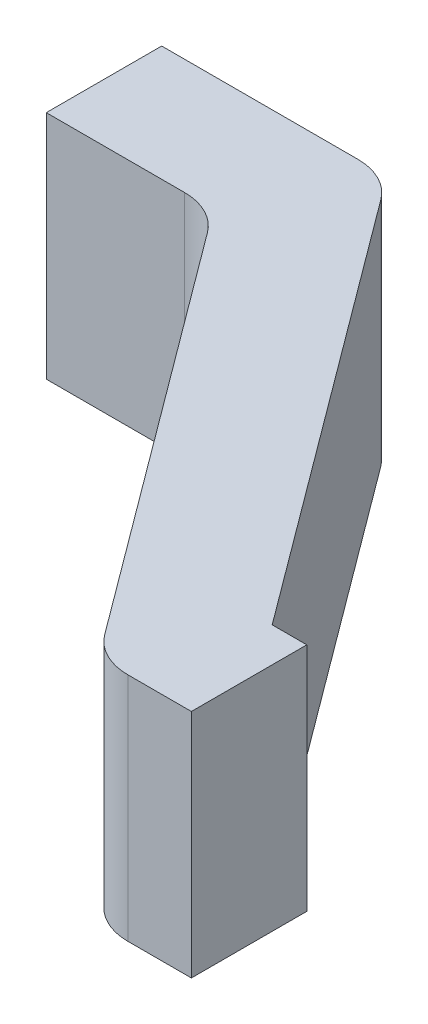
ISO-10303-21;
HEADER;
FILE_DESCRIPTION(('STEP AP214'),'2;1');
FILE_NAME('part.step','',(''),(''),'','','');
FILE_SCHEMA(('AUTOMOTIVE_DESIGN { 1 0 10303 214 1 1 1 1 }'));
ENDSEC;
DATA;
#1=APPLICATION_CONTEXT('core data for automotive mechanical design processes');
#2=APPLICATION_PROTOCOL_DEFINITION('international standard','automotive_design',2000,#1);
#3=PRODUCT_CONTEXT('',#1,'mechanical');
#4=PRODUCT('Part','Part','',(#3));
#5=PRODUCT_RELATED_PRODUCT_CATEGORY('part','',(#4));
#6=PRODUCT_DEFINITION_FORMATION('','',#4);
#7=PRODUCT_DEFINITION_CONTEXT('part definition',#1,'design');
#8=PRODUCT_DEFINITION('design','',#6,#7);
#9=PRODUCT_DEFINITION_SHAPE('','',#8);
#10=(LENGTH_UNIT() NAMED_UNIT(*) SI_UNIT(.MILLI.,.METRE.));
#11=(NAMED_UNIT(*) PLANE_ANGLE_UNIT() SI_UNIT($,.RADIAN.));
#12=(NAMED_UNIT(*) SI_UNIT($,.STERADIAN.) SOLID_ANGLE_UNIT());
#13=UNCERTAINTY_MEASURE_WITH_UNIT(LENGTH_MEASURE(1.E-05),#10,'distance_accuracy_value','');
#14=(GEOMETRIC_REPRESENTATION_CONTEXT(3) GLOBAL_UNCERTAINTY_ASSIGNED_CONTEXT((#13)) GLOBAL_UNIT_ASSIGNED_CONTEXT((#10,
#11,#12)) REPRESENTATION_CONTEXT('',''));
#15=CARTESIAN_POINT('',(0.,0.,0.));
#16=DIRECTION('',(0.,0.,1.));
#17=DIRECTION('',(1.,0.,0.));
#18=AXIS2_PLACEMENT_3D('',#15,#16,#17);
#19=CARTESIAN_POINT('',(-3.,-2.11,0.205));
#20=DIRECTION('',(0.,0.,1.));
#21=DIRECTION('',(1.,0.,0.));
#22=AXIS2_PLACEMENT_3D('',#19,#20,#21);
#23=PLANE('',#22);
#24=DIRECTION('',(1.,0.,0.));
#25=VECTOR('',#24,1.);
#26=CARTESIAN_POINT('',(-3.,-1.7,0.205));
#27=LINE('',#26,#25);
#28=CARTESIAN_POINT('',(-3.,-1.7,0.205));
#29=VERTEX_POINT('',#28);
#30=CARTESIAN_POINT('',(-2.754632601552,-1.7,0.205));
#31=VERTEX_POINT('',#30);
#32=EDGE_CURVE('E11',#29,#31,#27,.T.);
#33=ORIENTED_EDGE('',*,*,#32,.F.);
#34=DIRECTION('',(0.,1.,0.));
#35=VECTOR('',#34,1.);
#36=CARTESIAN_POINT('',(-3.,-2.11,0.205));
#37=LINE('',#36,#35);
#38=CARTESIAN_POINT('',(-3.,-2.11,0.205));
#39=VERTEX_POINT('',#38);
#40=EDGE_CURVE('E24',#39,#29,#37,.T.);
#41=ORIENTED_EDGE('',*,*,#40,.F.);
#42=DIRECTION('',(1.,0.,0.));
#43=VECTOR('',#42,1.);
#44=CARTESIAN_POINT('',(-3.,-2.11,0.205));
#45=LINE('',#44,#43);
#46=CARTESIAN_POINT('',(-2.754632601552,-2.11,0.205));
#47=VERTEX_POINT('',#46);
#48=EDGE_CURVE('E186',#39,#47,#45,.T.);
#49=ORIENTED_EDGE('',*,*,#48,.T.);
#50=DIRECTION('',(0.,1.,0.));
#51=VECTOR('',#50,1.);
#52=CARTESIAN_POINT('',(-2.754632601552,-2.11,0.205));
#53=LINE('',#52,#51);
#54=EDGE_CURVE('E184',#47,#31,#53,.T.);
#55=ORIENTED_EDGE('',*,*,#54,.T.);
#56=EDGE_LOOP('',(#33,#41,#49,#55));
#57=FACE_BOUND('',#56,.T.);
#58=ADVANCED_FACE('F17',(#57),#23,.T.);
#59=CARTESIAN_POINT('',(-3.,-1.7,0.));
#60=DIRECTION('',(0.,1.,0.));
#61=DIRECTION('',(0.,0.,1.));
#62=AXIS2_PLACEMENT_3D('',#59,#60,#61);
#63=PLANE('',#62);
#64=DIRECTION('',(1.,0.,0.));
#65=VECTOR('',#64,1.);
#66=CARTESIAN_POINT('',(-3.,-1.7,0.));
#67=LINE('',#66,#65);
#68=CARTESIAN_POINT('',(-3.,-1.7,0.));
#69=VERTEX_POINT('',#68);
#70=CARTESIAN_POINT('',(-2.651544200517,-1.7,0.));
#71=VERTEX_POINT('',#70);
#72=EDGE_CURVE('E182',#69,#71,#67,.T.);
#73=ORIENTED_EDGE('',*,*,#72,.F.);
#74=DIRECTION('',(0.,0.,1.));
#75=VECTOR('',#74,1.);
#76=CARTESIAN_POINT('',(-3.,-1.7,0.));
#77=LINE('',#76,#75);
#78=EDGE_CURVE('E180',#69,#29,#77,.T.);
#79=ORIENTED_EDGE('',*,*,#78,.T.);
#80=ORIENTED_EDGE('',*,*,#32,.T.);
#81=CARTESIAN_POINT('',(-2.754632601552,-1.7,0.3075));
#82=DIRECTION('',(0.,-1.,0.));
#83=DIRECTION('',(0.,0.,1.));
#84=AXIS2_PLACEMENT_3D('',#81,#82,#83);
#85=CIRCLE('',#84,0.1025);
#86=CARTESIAN_POINT('',(-2.672351357136,-1.7,0.246376789863));
#87=VERTEX_POINT('',#86);
#88=EDGE_CURVE('E178',#31,#87,#85,.T.);
#89=ORIENTED_EDGE('',*,*,#88,.T.);
#90=DIRECTION('',(0.596324001338072,0.,0.802743847954097));
#91=VECTOR('',#90,1.);
#92=CARTESIAN_POINT('',(-2.764562488831,-1.7,0.122246420274));
#93=LINE('',#92,#91);
#94=CARTESIAN_POINT('',(-2.145299532729,-1.7,0.955869630411));
#95=VERTEX_POINT('',#94);
#96=EDGE_CURVE('E176',#87,#95,#93,.T.);
#97=ORIENTED_EDGE('',*,*,#96,.T.);
#98=CARTESIAN_POINT('',(-2.063018288313,-1.7,0.894746420274));
#99=DIRECTION('',(0.,1.,0.));
#100=DIRECTION('',(0.,0.,1.));
#101=AXIS2_PLACEMENT_3D('',#98,#99,#100);
#102=CIRCLE('',#101,0.1025);
#103=CARTESIAN_POINT('',(-2.063018288313,-1.7,0.997246420274));
#104=VERTEX_POINT('',#103);
#105=EDGE_CURVE('E120',#95,#104,#102,.T.);
#106=ORIENTED_EDGE('',*,*,#105,.T.);
#107=DIRECTION('',(1.,0.,0.));
#108=VECTOR('',#107,1.);
#109=CARTESIAN_POINT('',(-2.114562488831,-1.7,0.997246420274));
#110=LINE('',#109,#108);
#111=CARTESIAN_POINT('',(-1.95,-1.7,0.997246420274));
#112=VERTEX_POINT('',#111);
#113=EDGE_CURVE('E173',#104,#112,#110,.T.);
#114=ORIENTED_EDGE('',*,*,#113,.T.);
#115=DIRECTION('',(0.,0.,1.));
#116=VECTOR('',#115,1.);
#117=CARTESIAN_POINT('',(-1.95,-1.7,0.792246420274));
#118=LINE('',#117,#116);
#119=CARTESIAN_POINT('',(-1.95,-1.7,0.792246420274));
#120=VERTEX_POINT('',#119);
#121=EDGE_CURVE('E170',#120,#112,#118,.T.);
#122=ORIENTED_EDGE('',*,*,#121,.F.);
#123=DIRECTION('',(1.,0.,0.));
#124=VECTOR('',#123,1.);
#125=CARTESIAN_POINT('',(-2.114562488831,-1.7,0.792246420274));
#126=LINE('',#125,#124);
#127=CARTESIAN_POINT('',(-2.011474087796,-1.7,0.792246420274));
#128=VERTEX_POINT('',#127);
#129=EDGE_CURVE('E167',#128,#120,#126,.T.);
#130=ORIENTED_EDGE('',*,*,#129,.F.);
#131=DIRECTION('',(0.596324001338072,0.,0.802743847954097));
#132=VECTOR('',#131,1.);
#133=CARTESIAN_POINT('',(-2.6,-1.7,0.));
#134=LINE('',#133,#132);
#135=CARTESIAN_POINT('',(-2.569262956102,-1.7,0.0413767898629));
#136=VERTEX_POINT('',#135);
#137=EDGE_CURVE('E164',#136,#128,#134,.T.);
#138=ORIENTED_EDGE('',*,*,#137,.F.);
#139=CARTESIAN_POINT('',(-2.651544200517,-1.7,0.1025));
#140=DIRECTION('',(0.,-1.,0.));
#141=DIRECTION('',(0.,0.,1.));
#142=AXIS2_PLACEMENT_3D('',#139,#140,#141);
#143=CIRCLE('',#142,0.1025);
#144=EDGE_CURVE('E161',#71,#136,#143,.T.);
#145=ORIENTED_EDGE('',*,*,#144,.F.);
#146=EDGE_LOOP('',(#73,#79,#80,#89,#97,#106,#114,#122,#130,#138,#145));
#147=FACE_BOUND('',#146,.T.);
#148=ADVANCED_FACE('F192',(#147),#63,.T.);
#149=CARTESIAN_POINT('',(-2.754632601552,-2.11,0.3075));
#150=DIRECTION('',(0.,1.,0.));
#151=DIRECTION('',(0.,0.,-1.));
#152=AXIS2_PLACEMENT_3D('',#149,#150,#151);
#153=CYLINDRICAL_SURFACE('',#152,0.1025);
#154=CARTESIAN_POINT('',(-2.754632601552,-2.11,0.3075));
#155=DIRECTION('',(0.,-1.,0.));
#156=DIRECTION('',(0.,0.,1.));
#157=AXIS2_PLACEMENT_3D('',#154,#155,#156);
#158=CIRCLE('',#157,0.1025);
#159=CARTESIAN_POINT('',(-2.672351357136,-2.11,0.246376789863));
#160=VERTEX_POINT('',#159);
#161=EDGE_CURVE('E159',#47,#160,#158,.T.);
#162=ORIENTED_EDGE('',*,*,#161,.T.);
#163=DIRECTION('',(0.,1.,0.));
#164=VECTOR('',#163,1.);
#165=CARTESIAN_POINT('',(-2.672351357136,-2.11,0.246376789863));
#166=LINE('',#165,#164);
#167=EDGE_CURVE('E102',#160,#87,#166,.T.);
#168=ORIENTED_EDGE('',*,*,#167,.T.);
#169=ORIENTED_EDGE('',*,*,#88,.F.);
#170=ORIENTED_EDGE('',*,*,#54,.F.);
#171=EDGE_LOOP('',(#162,#168,#169,#170));
#172=FACE_BOUND('',#171,.T.);
#173=ADVANCED_FACE('F216',(#172),#153,.F.);
#174=CARTESIAN_POINT('',(-3.,-2.11,0.));
#175=DIRECTION('',(1.,0.,0.));
#176=DIRECTION('',(0.,0.,1.));
#177=AXIS2_PLACEMENT_3D('',#174,#175,#176);
#178=PLANE('',#177);
#179=ORIENTED_EDGE('',*,*,#40,.T.);
#180=ORIENTED_EDGE('',*,*,#78,.F.);
#181=DIRECTION('',(0.,1.,0.));
#182=VECTOR('',#181,1.);
#183=CARTESIAN_POINT('',(-3.,-2.11,0.));
#184=LINE('',#183,#182);
#185=CARTESIAN_POINT('',(-3.,-2.11,0.));
#186=VERTEX_POINT('',#185);
#187=EDGE_CURVE('E155',#186,#69,#184,.T.);
#188=ORIENTED_EDGE('',*,*,#187,.F.);
#189=DIRECTION('',(0.,0.,1.));
#190=VECTOR('',#189,1.);
#191=CARTESIAN_POINT('',(-3.,-2.11,0.));
#192=LINE('',#191,#190);
#193=EDGE_CURVE('E152',#186,#39,#192,.T.);
#194=ORIENTED_EDGE('',*,*,#193,.T.);
#195=EDGE_LOOP('',(#179,#180,#188,#194));
#196=FACE_BOUND('',#195,.T.);
#197=ADVANCED_FACE('F189',(#196),#178,.F.);
#198=CARTESIAN_POINT('',(-3.,-2.11,0.));
#199=DIRECTION('',(0.,1.,0.));
#200=DIRECTION('',(0.,0.,1.));
#201=AXIS2_PLACEMENT_3D('',#198,#199,#200);
#202=PLANE('',#201);
#203=CARTESIAN_POINT('',(-2.651544200517,-2.11,0.1025));
#204=DIRECTION('',(0.,-1.,0.));
#205=DIRECTION('',(0.,0.,1.));
#206=AXIS2_PLACEMENT_3D('',#203,#204,#205);
#207=CIRCLE('',#206,0.1025);
#208=CARTESIAN_POINT('',(-2.651544200517,-2.11,0.));
#209=VERTEX_POINT('',#208);
#210=CARTESIAN_POINT('',(-2.569262956102,-2.11,0.0413767898629));
#211=VERTEX_POINT('',#210);
#212=EDGE_CURVE('E150',#209,#211,#207,.T.);
#213=ORIENTED_EDGE('',*,*,#212,.T.);
#214=DIRECTION('',(0.596324001338072,0.,0.802743847954097));
#215=VECTOR('',#214,1.);
#216=CARTESIAN_POINT('',(-2.6,-2.11,0.));
#217=LINE('',#216,#215);
#218=CARTESIAN_POINT('',(-2.011474087796,-2.11,0.792246420274));
#219=VERTEX_POINT('',#218);
#220=EDGE_CURVE('E147',#211,#219,#217,.T.);
#221=ORIENTED_EDGE('',*,*,#220,.T.);
#222=DIRECTION('',(1.,0.,0.));
#223=VECTOR('',#222,1.);
#224=CARTESIAN_POINT('',(-2.114562488831,-2.11,0.792246420274));
#225=LINE('',#224,#223);
#226=CARTESIAN_POINT('',(-1.95,-2.11,0.792246420274));
#227=VERTEX_POINT('',#226);
#228=EDGE_CURVE('E144',#219,#227,#225,.T.);
#229=ORIENTED_EDGE('',*,*,#228,.T.);
#230=DIRECTION('',(0.,0.,1.));
#231=VECTOR('',#230,1.);
#232=CARTESIAN_POINT('',(-1.95,-2.11,0.792246420274));
#233=LINE('',#232,#231);
#234=CARTESIAN_POINT('',(-1.95,-2.11,0.997246420274));
#235=VERTEX_POINT('',#234);
#236=EDGE_CURVE('E142',#227,#235,#233,.T.);
#237=ORIENTED_EDGE('',*,*,#236,.T.);
#238=DIRECTION('',(1.,0.,0.));
#239=VECTOR('',#238,1.);
#240=CARTESIAN_POINT('',(-2.114562488831,-2.11,0.997246420274));
#241=LINE('',#240,#239);
#242=CARTESIAN_POINT('',(-2.063018288313,-2.11,0.997246420274));
#243=VERTEX_POINT('',#242);
#244=EDGE_CURVE('E113',#243,#235,#241,.T.);
#245=ORIENTED_EDGE('',*,*,#244,.F.);
#246=CARTESIAN_POINT('',(-2.063018288313,-2.11,0.894746420274));
#247=DIRECTION('',(0.,1.,0.));
#248=DIRECTION('',(0.,0.,1.));
#249=AXIS2_PLACEMENT_3D('',#246,#247,#248);
#250=CIRCLE('',#249,0.1025);
#251=CARTESIAN_POINT('',(-2.145299532729,-2.11,0.955869630411));
#252=VERTEX_POINT('',#251);
#253=EDGE_CURVE('E106',#252,#243,#250,.T.);
#254=ORIENTED_EDGE('',*,*,#253,.F.);
#255=DIRECTION('',(0.596324001338072,0.,0.802743847954097));
#256=VECTOR('',#255,1.);
#257=CARTESIAN_POINT('',(-2.764562488831,-2.11,0.122246420274));
#258=LINE('',#257,#256);
#259=EDGE_CURVE('E95',#160,#252,#258,.T.);
#260=ORIENTED_EDGE('',*,*,#259,.F.);
#261=ORIENTED_EDGE('',*,*,#161,.F.);
#262=ORIENTED_EDGE('',*,*,#48,.F.);
#263=ORIENTED_EDGE('',*,*,#193,.F.);
#264=DIRECTION('',(1.,0.,0.));
#265=VECTOR('',#264,1.);
#266=CARTESIAN_POINT('',(-3.,-2.11,0.));
#267=LINE('',#266,#265);
#268=EDGE_CURVE('E107',#186,#209,#267,.T.);
#269=ORIENTED_EDGE('',*,*,#268,.T.);
#270=EDGE_LOOP('',(#213,#221,#229,#237,#245,#254,#260,#261,#262,#263,#269));
#271=FACE_BOUND('',#270,.T.);
#272=ADVANCED_FACE('F111',(#271),#202,.F.);
#273=CARTESIAN_POINT('',(-3.,-2.11,0.));
#274=DIRECTION('',(0.,0.,1.));
#275=DIRECTION('',(1.,0.,0.));
#276=AXIS2_PLACEMENT_3D('',#273,#274,#275);
#277=PLANE('',#276);
#278=DIRECTION('',(0.,1.,0.));
#279=VECTOR('',#278,1.);
#280=CARTESIAN_POINT('',(-2.651544200517,-2.11,0.));
#281=LINE('',#280,#279);
#282=EDGE_CURVE('E137',#209,#71,#281,.T.);
#283=ORIENTED_EDGE('',*,*,#282,.F.);
#284=ORIENTED_EDGE('',*,*,#268,.F.);
#285=ORIENTED_EDGE('',*,*,#187,.T.);
#286=ORIENTED_EDGE('',*,*,#72,.T.);
#287=EDGE_LOOP('',(#283,#284,#285,#286));
#288=FACE_BOUND('',#287,.T.);
#289=ADVANCED_FACE('F196',(#288),#277,.F.);
#290=CARTESIAN_POINT('',(-2.651544200517,-2.11,0.1025));
#291=DIRECTION('',(0.,1.,0.));
#292=DIRECTION('',(0.,0.,-1.));
#293=AXIS2_PLACEMENT_3D('',#290,#291,#292);
#294=CYLINDRICAL_SURFACE('',#293,0.1025);
#295=ORIENTED_EDGE('',*,*,#282,.T.);
#296=ORIENTED_EDGE('',*,*,#144,.T.);
#297=DIRECTION('',(0.,1.,0.));
#298=VECTOR('',#297,1.);
#299=CARTESIAN_POINT('',(-2.569262956102,-2.11,0.0413767898629));
#300=LINE('',#299,#298);
#301=EDGE_CURVE('E134',#211,#136,#300,.T.);
#302=ORIENTED_EDGE('',*,*,#301,.F.);
#303=ORIENTED_EDGE('',*,*,#212,.F.);
#304=EDGE_LOOP('',(#295,#296,#302,#303));
#305=FACE_BOUND('',#304,.T.);
#306=ADVANCED_FACE('F201',(#305),#294,.T.);
#307=CARTESIAN_POINT('',(-2.6,-2.11,0.));
#308=DIRECTION('',(0.802743847954097,0.,-0.596324001338072));
#309=DIRECTION('',(0.596324001338072,0.,0.802743847954097));
#310=AXIS2_PLACEMENT_3D('',#307,#308,#309);
#311=PLANE('',#310);
#312=ORIENTED_EDGE('',*,*,#220,.F.);
#313=ORIENTED_EDGE('',*,*,#301,.T.);
#314=ORIENTED_EDGE('',*,*,#137,.T.);
#315=DIRECTION('',(0.,1.,0.));
#316=VECTOR('',#315,1.);
#317=CARTESIAN_POINT('',(-2.011474087796,-2.11,0.792246420274));
#318=LINE('',#317,#316);
#319=EDGE_CURVE('E131',#219,#128,#318,.T.);
#320=ORIENTED_EDGE('',*,*,#319,.F.);
#321=EDGE_LOOP('',(#312,#313,#314,#320));
#322=FACE_BOUND('',#321,.T.);
#323=ADVANCED_FACE('F203',(#322),#311,.T.);
#324=CARTESIAN_POINT('',(-2.114562488831,-2.11,0.792246420274));
#325=DIRECTION('',(0.,0.,1.));
#326=DIRECTION('',(1.,0.,0.));
#327=AXIS2_PLACEMENT_3D('',#324,#325,#326);
#328=PLANE('',#327);
#329=DIRECTION('',(0.,1.,0.));
#330=VECTOR('',#329,1.);
#331=CARTESIAN_POINT('',(-1.95,-2.11,0.792246420274));
#332=LINE('',#331,#330);
#333=EDGE_CURVE('E125',#227,#120,#332,.T.);
#334=ORIENTED_EDGE('',*,*,#333,.F.);
#335=ORIENTED_EDGE('',*,*,#228,.F.);
#336=ORIENTED_EDGE('',*,*,#319,.T.);
#337=ORIENTED_EDGE('',*,*,#129,.T.);
#338=EDGE_LOOP('',(#334,#335,#336,#337));
#339=FACE_BOUND('',#338,.T.);
#340=ADVANCED_FACE('F208',(#339),#328,.F.);
#341=CARTESIAN_POINT('',(-1.95,-2.11,0.792246420274));
#342=DIRECTION('',(1.,0.,0.));
#343=DIRECTION('',(0.,0.,1.));
#344=AXIS2_PLACEMENT_3D('',#341,#342,#343);
#345=PLANE('',#344);
#346=ORIENTED_EDGE('',*,*,#236,.F.);
#347=ORIENTED_EDGE('',*,*,#333,.T.);
#348=ORIENTED_EDGE('',*,*,#121,.T.);
#349=DIRECTION('',(0.,1.,0.));
#350=VECTOR('',#349,1.);
#351=CARTESIAN_POINT('',(-1.95,-2.11,0.997246420274));
#352=LINE('',#351,#350);
#353=EDGE_CURVE('E121',#235,#112,#352,.T.);
#354=ORIENTED_EDGE('',*,*,#353,.F.);
#355=EDGE_LOOP('',(#346,#347,#348,#354));
#356=FACE_BOUND('',#355,.T.);
#357=ADVANCED_FACE('F210',(#356),#345,.T.);
#358=CARTESIAN_POINT('',(-2.764562488831,-2.11,0.122246420274));
#359=DIRECTION('',(0.802743847954097,0.,-0.596324001338072));
#360=DIRECTION('',(0.596324001338072,0.,0.802743847954097));
#361=AXIS2_PLACEMENT_3D('',#358,#359,#360);
#362=PLANE('',#361);
#363=DIRECTION('',(0.,1.,0.));
#364=VECTOR('',#363,1.);
#365=CARTESIAN_POINT('',(-2.145299532729,-2.11,0.955869630411));
#366=LINE('',#365,#364);
#367=EDGE_CURVE('E100',#252,#95,#366,.T.);
#368=ORIENTED_EDGE('',*,*,#367,.T.);
#369=ORIENTED_EDGE('',*,*,#96,.F.);
#370=ORIENTED_EDGE('',*,*,#167,.F.);
#371=ORIENTED_EDGE('',*,*,#259,.T.);
#372=EDGE_LOOP('',(#368,#369,#370,#371));
#373=FACE_BOUND('',#372,.T.);
#374=ADVANCED_FACE('F97',(#373),#362,.F.);
#375=CARTESIAN_POINT('',(-2.114562488831,-2.11,0.997246420274));
#376=DIRECTION('',(0.,0.,1.));
#377=DIRECTION('',(1.,0.,0.));
#378=AXIS2_PLACEMENT_3D('',#375,#376,#377);
#379=PLANE('',#378);
#380=ORIENTED_EDGE('',*,*,#244,.T.);
#381=ORIENTED_EDGE('',*,*,#353,.T.);
#382=ORIENTED_EDGE('',*,*,#113,.F.);
#383=DIRECTION('',(0.,1.,0.));
#384=VECTOR('',#383,1.);
#385=CARTESIAN_POINT('',(-2.063018288313,-2.11,0.997246420274));
#386=LINE('',#385,#384);
#387=EDGE_CURVE('E122',#243,#104,#386,.T.);
#388=ORIENTED_EDGE('',*,*,#387,.F.);
#389=EDGE_LOOP('',(#380,#381,#382,#388));
#390=FACE_BOUND('',#389,.T.);
#391=ADVANCED_FACE('F213',(#390),#379,.T.);
#392=CARTESIAN_POINT('',(-2.063018288313,-2.11,0.894746420274));
#393=DIRECTION('',(0.,1.,0.));
#394=DIRECTION('',(-0.802743847954097,0.,0.596324001338072));
#395=AXIS2_PLACEMENT_3D('',#392,#393,#394);
#396=CYLINDRICAL_SURFACE('',#395,0.1025);
#397=ORIENTED_EDGE('',*,*,#253,.T.);
#398=ORIENTED_EDGE('',*,*,#387,.T.);
#399=ORIENTED_EDGE('',*,*,#105,.F.);
#400=ORIENTED_EDGE('',*,*,#367,.F.);
#401=EDGE_LOOP('',(#397,#398,#399,#400));
#402=FACE_BOUND('',#401,.T.);
#403=ADVANCED_FACE('F119',(#402),#396,.T.);
#404=CLOSED_SHELL('',(#58,#148,#173,#197,#272,#289,#306,#323,#340,#357,#374,#391,#403));
#405=MANIFOLD_SOLID_BREP('B1',#404);
#406=ADVANCED_BREP_SHAPE_REPRESENTATION('',(#18,#405),#14);
#407=SHAPE_DEFINITION_REPRESENTATION(#9,#406);
ENDSEC;
END-ISO-10303-21;
